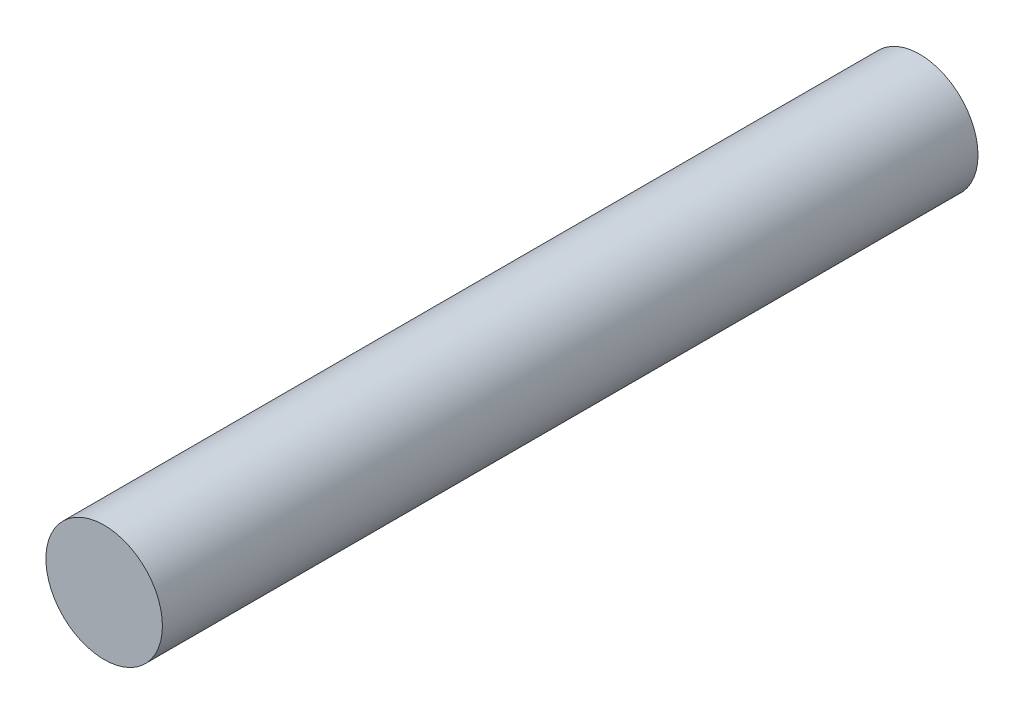
ISO-10303-21;
HEADER;
FILE_DESCRIPTION(('STEP AP214'),'2;1');
FILE_NAME('part.step','',(''),(''),'','','');
FILE_SCHEMA(('AUTOMOTIVE_DESIGN { 1 0 10303 214 1 1 1 1 }'));
ENDSEC;
DATA;
#1=APPLICATION_CONTEXT('core data for automotive mechanical design processes');
#2=APPLICATION_PROTOCOL_DEFINITION('international standard','automotive_design',2000,#1);
#3=PRODUCT_CONTEXT('',#1,'mechanical');
#4=PRODUCT('Part','Part','',(#3));
#5=PRODUCT_RELATED_PRODUCT_CATEGORY('part','',(#4));
#6=PRODUCT_DEFINITION_FORMATION('','',#4);
#7=PRODUCT_DEFINITION_CONTEXT('part definition',#1,'design');
#8=PRODUCT_DEFINITION('design','',#6,#7);
#9=PRODUCT_DEFINITION_SHAPE('','',#8);
#10=(LENGTH_UNIT() NAMED_UNIT(*) SI_UNIT(.MILLI.,.METRE.));
#11=(NAMED_UNIT(*) PLANE_ANGLE_UNIT() SI_UNIT($,.RADIAN.));
#12=(NAMED_UNIT(*) SI_UNIT($,.STERADIAN.) SOLID_ANGLE_UNIT());
#13=UNCERTAINTY_MEASURE_WITH_UNIT(LENGTH_MEASURE(1.E-05),#10,'distance_accuracy_value','');
#14=(GEOMETRIC_REPRESENTATION_CONTEXT(3) GLOBAL_UNCERTAINTY_ASSIGNED_CONTEXT((#13)) GLOBAL_UNIT_ASSIGNED_CONTEXT((#10,
#11,#12)) REPRESENTATION_CONTEXT('',''));
#15=CARTESIAN_POINT('',(0.,0.,0.));
#16=DIRECTION('',(0.,0.,1.));
#17=DIRECTION('',(1.,0.,0.));
#18=AXIS2_PLACEMENT_3D('',#15,#16,#17);
#19=CARTESIAN_POINT('',(0.,0.,35.));
#20=DIRECTION('',(0.,0.,-1.));
#21=DIRECTION('',(-1.,0.,0.));
#22=AXIS2_PLACEMENT_3D('',#19,#20,#21);
#23=CYLINDRICAL_SURFACE('',#22,2.5);
#24=CARTESIAN_POINT('',(0.,0.,35.));
#25=DIRECTION('',(0.,0.,1.));
#26=DIRECTION('',(1.,0.,0.));
#27=AXIS2_PLACEMENT_3D('',#24,#25,#26);
#28=CIRCLE('',#27,2.5);
#29=CARTESIAN_POINT('',(2.5,0.,35.));
#30=VERTEX_POINT('',#29);
#31=EDGE_CURVE('E10',#30,#30,#28,.T.);
#32=ORIENTED_EDGE('',*,*,#31,.F.);
#33=EDGE_LOOP('',(#32));
#34=FACE_BOUND('',#33,.T.);
#35=CARTESIAN_POINT('',(0.,0.,0.));
#36=DIRECTION('',(0.,0.,1.));
#37=DIRECTION('',(1.,0.,0.));
#38=AXIS2_PLACEMENT_3D('',#35,#36,#37);
#39=CIRCLE('',#38,2.5);
#40=CARTESIAN_POINT('',(2.5,0.,0.));
#41=VERTEX_POINT('',#40);
#42=EDGE_CURVE('E36',#41,#41,#39,.T.);
#43=ORIENTED_EDGE('',*,*,#42,.T.);
#44=EDGE_LOOP('',(#43));
#45=FACE_BOUND('',#44,.T.);
#46=ADVANCED_FACE('F33',(#34,#45),#23,.T.);
#47=CARTESIAN_POINT('',(0.,0.,35.));
#48=DIRECTION('',(0.,0.,1.));
#49=DIRECTION('',(1.,0.,0.));
#50=AXIS2_PLACEMENT_3D('',#47,#48,#49);
#51=PLANE('',#50);
#52=ORIENTED_EDGE('',*,*,#31,.T.);
#53=EDGE_LOOP('',(#52));
#54=FACE_BOUND('',#53,.T.);
#55=ADVANCED_FACE('F48',(#54),#51,.T.);
#56=CARTESIAN_POINT('',(0.,0.,0.));
#57=DIRECTION('',(0.,0.,1.));
#58=DIRECTION('',(1.,0.,0.));
#59=AXIS2_PLACEMENT_3D('',#56,#57,#58);
#60=PLANE('',#59);
#61=ORIENTED_EDGE('',*,*,#42,.F.);
#62=EDGE_LOOP('',(#61));
#63=FACE_BOUND('',#62,.T.);
#64=ADVANCED_FACE('F46',(#63),#60,.F.);
#65=CLOSED_SHELL('',(#46,#55,#64));
#66=MANIFOLD_SOLID_BREP('B2',#65);
#67=ADVANCED_BREP_SHAPE_REPRESENTATION('',(#18,#66),#14);
#68=SHAPE_DEFINITION_REPRESENTATION(#9,#67);
ENDSEC;
END-ISO-10303-21;
